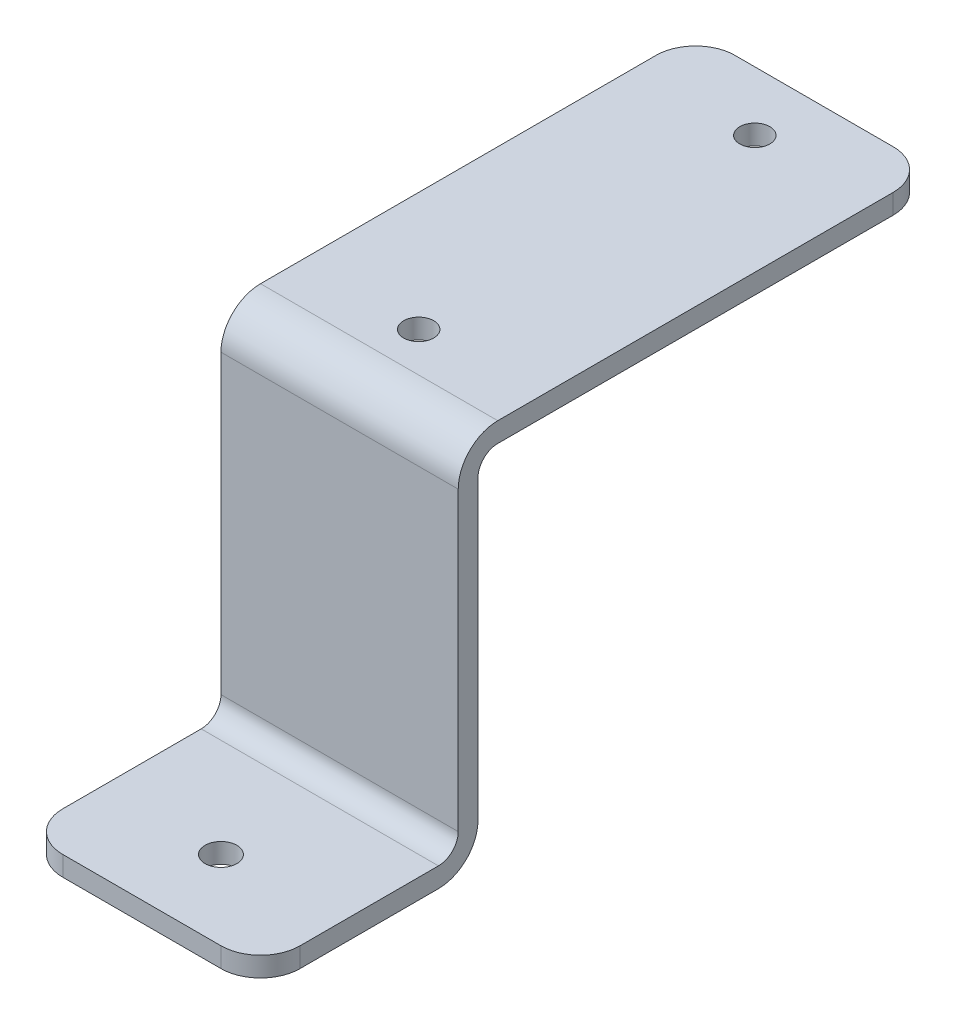
ISO-10303-21;
HEADER;
FILE_DESCRIPTION(('STEP AP214'),'2;1');
FILE_NAME('part.step','',(''),(''),'','','');
FILE_SCHEMA(('AUTOMOTIVE_DESIGN { 1 0 10303 214 1 1 1 1 }'));
ENDSEC;
DATA;
#1=APPLICATION_CONTEXT('core data for automotive mechanical design processes');
#2=APPLICATION_PROTOCOL_DEFINITION('international standard','automotive_design',2000,#1);
#3=PRODUCT_CONTEXT('',#1,'mechanical');
#4=PRODUCT('Part','Part','',(#3));
#5=PRODUCT_RELATED_PRODUCT_CATEGORY('part','',(#4));
#6=PRODUCT_DEFINITION_FORMATION('','',#4);
#7=PRODUCT_DEFINITION_CONTEXT('part definition',#1,'design');
#8=PRODUCT_DEFINITION('design','',#6,#7);
#9=PRODUCT_DEFINITION_SHAPE('','',#8);
#10=(LENGTH_UNIT() NAMED_UNIT(*) SI_UNIT(.MILLI.,.METRE.));
#11=(NAMED_UNIT(*) PLANE_ANGLE_UNIT() SI_UNIT($,.RADIAN.));
#12=(NAMED_UNIT(*) SI_UNIT($,.STERADIAN.) SOLID_ANGLE_UNIT());
#13=UNCERTAINTY_MEASURE_WITH_UNIT(LENGTH_MEASURE(1.E-05),#10,'distance_accuracy_value','');
#14=(GEOMETRIC_REPRESENTATION_CONTEXT(3) GLOBAL_UNCERTAINTY_ASSIGNED_CONTEXT((#13)) GLOBAL_UNIT_ASSIGNED_CONTEXT((#10,
#11,#12)) REPRESENTATION_CONTEXT('',''));
#15=CARTESIAN_POINT('',(0.,0.,0.));
#16=DIRECTION('',(0.,0.,1.));
#17=DIRECTION('',(1.,0.,0.));
#18=AXIS2_PLACEMENT_3D('',#15,#16,#17);
#19=CARTESIAN_POINT('',(-19.05,-60.325,0.));
#20=DIRECTION('',(0.,1.,0.));
#21=DIRECTION('',(0.,0.,1.));
#22=AXIS2_PLACEMENT_3D('',#19,#20,#21);
#23=PLANE('',#22);
#24=CARTESIAN_POINT('',(0.,-60.325,19.05));
#25=DIRECTION('',(0.,-1.,0.));
#26=DIRECTION('',(0.,0.,-1.));
#27=AXIS2_PLACEMENT_3D('',#24,#25,#26);
#28=CIRCLE('',#27,2.5527);
#29=CARTESIAN_POINT('',(0.,-60.325,16.4973));
#30=VERTEX_POINT('',#29);
#31=EDGE_CURVE('P0_E150',#30,#30,#28,.F.);
#32=ORIENTED_EDGE('',*,*,#31,.T.);
#33=EDGE_LOOP('',(#32));
#34=FACE_BOUND('',#33,.T.);
#35=CARTESIAN_POINT('',(-12.7,-60.325,25.4));
#36=DIRECTION('',(0.,1.,0.));
#37=DIRECTION('',(0.,0.,1.));
#38=AXIS2_PLACEMENT_3D('',#35,#36,#37);
#39=CIRCLE('',#38,6.35);
#40=CARTESIAN_POINT('',(-19.05,-60.325,25.4));
#41=VERTEX_POINT('',#40);
#42=CARTESIAN_POINT('',(-12.7,-60.325,31.75));
#43=VERTEX_POINT('',#42);
#44=EDGE_CURVE('P0_E20',#41,#43,#39,.T.);
#45=ORIENTED_EDGE('',*,*,#44,.F.);
#46=DIRECTION('',(0.,0.,1.));
#47=VECTOR('',#46,1.);
#48=CARTESIAN_POINT('',(-19.05,-60.325,15.08125));
#49=LINE('',#48,#47);
#50=CARTESIAN_POINT('',(-19.05,-60.325,3.175));
#51=VERTEX_POINT('',#50);
#52=EDGE_CURVE('P0_E129',#51,#41,#49,.T.);
#53=ORIENTED_EDGE('',*,*,#52,.F.);
#54=DIRECTION('',(1.,0.,0.));
#55=VECTOR('',#54,1.);
#56=CARTESIAN_POINT('',(-19.05,-60.325,3.175));
#57=LINE('',#56,#55);
#58=CARTESIAN_POINT('',(19.05,-60.325,3.175));
#59=VERTEX_POINT('',#58);
#60=EDGE_CURVE('P0_E234',#59,#51,#57,.F.);
#61=ORIENTED_EDGE('',*,*,#60,.F.);
#62=DIRECTION('',(0.,0.,1.));
#63=VECTOR('',#62,1.);
#64=CARTESIAN_POINT('',(19.05,-60.325,15.08125));
#65=LINE('',#64,#63);
#66=CARTESIAN_POINT('',(19.05,-60.325,25.4));
#67=VERTEX_POINT('',#66);
#68=EDGE_CURVE('P0_E157',#59,#67,#65,.T.);
#69=ORIENTED_EDGE('',*,*,#68,.T.);
#70=CARTESIAN_POINT('',(12.7,-60.325,25.4));
#71=DIRECTION('',(0.,1.,0.));
#72=DIRECTION('',(0.,0.,1.));
#73=AXIS2_PLACEMENT_3D('',#70,#71,#72);
#74=CIRCLE('',#73,6.35);
#75=CARTESIAN_POINT('',(12.7,-60.325,31.75));
#76=VERTEX_POINT('',#75);
#77=EDGE_CURVE('P0_E153',#76,#67,#74,.T.);
#78=ORIENTED_EDGE('',*,*,#77,.F.);
#79=DIRECTION('',(1.,0.,0.));
#80=VECTOR('',#79,1.);
#81=CARTESIAN_POINT('',(0.,-60.325,31.75));
#82=LINE('',#81,#80);
#83=EDGE_CURVE('P0_E132',#43,#76,#82,.T.);
#84=ORIENTED_EDGE('',*,*,#83,.F.);
#85=EDGE_LOOP('',(#45,#53,#61,#69,#78,#84));
#86=FACE_BOUND('',#85,.T.);
#87=ADVANCED_FACE('P0_F17',(#34,#86),#23,.F.);
#88=CARTESIAN_POINT('',(-12.7,-138.96467,25.4));
#89=DIRECTION('',(0.,1.,0.));
#90=DIRECTION('',(0.,0.,1.));
#91=AXIS2_PLACEMENT_3D('',#88,#89,#90);
#92=CYLINDRICAL_SURFACE('',#91,6.35);
#93=DIRECTION('',(0.,1.,0.));
#94=VECTOR('',#93,1.);
#95=CARTESIAN_POINT('',(-12.7,-58.7375,31.75));
#96=LINE('',#95,#94);
#97=CARTESIAN_POINT('',(-12.7,-57.15,31.75));
#98=VERTEX_POINT('',#97);
#99=EDGE_CURVE('P0_E135',#98,#43,#96,.F.);
#100=ORIENTED_EDGE('',*,*,#99,.F.);
#101=CARTESIAN_POINT('',(-12.7,-57.15,25.4));
#102=DIRECTION('',(0.,1.,0.));
#103=DIRECTION('',(0.,0.,1.));
#104=AXIS2_PLACEMENT_3D('',#101,#102,#103);
#105=CIRCLE('',#104,6.35);
#106=CARTESIAN_POINT('',(-19.05,-57.15,25.4));
#107=VERTEX_POINT('',#106);
#108=EDGE_CURVE('P0_E140',#107,#98,#105,.T.);
#109=ORIENTED_EDGE('',*,*,#108,.F.);
#110=DIRECTION('',(0.,1.,0.));
#111=VECTOR('',#110,1.);
#112=CARTESIAN_POINT('',(-19.05,-58.7375,25.4));
#113=LINE('',#112,#111);
#114=EDGE_CURVE('P0_E137',#41,#107,#113,.T.);
#115=ORIENTED_EDGE('',*,*,#114,.F.);
#116=ORIENTED_EDGE('',*,*,#44,.T.);
#117=EDGE_LOOP('',(#100,#109,#115,#116));
#118=FACE_BOUND('',#117,.T.);
#119=ADVANCED_FACE('P0_F138',(#118),#92,.T.);
#120=CARTESIAN_POINT('',(0.,-58.7375,31.75));
#121=DIRECTION('',(0.,0.,1.));
#122=DIRECTION('',(1.,0.,0.));
#123=AXIS2_PLACEMENT_3D('',#120,#121,#122);
#124=PLANE('',#123);
#125=ORIENTED_EDGE('',*,*,#83,.T.);
#126=DIRECTION('',(0.,1.,0.));
#127=VECTOR('',#126,1.);
#128=CARTESIAN_POINT('',(12.7,-138.96467,31.75));
#129=LINE('',#128,#127);
#130=CARTESIAN_POINT('',(12.7,-57.15,31.75));
#131=VERTEX_POINT('',#130);
#132=EDGE_CURVE('P0_E159',#131,#76,#129,.F.);
#133=ORIENTED_EDGE('',*,*,#132,.F.);
#134=DIRECTION('',(1.,0.,0.));
#135=VECTOR('',#134,1.);
#136=CARTESIAN_POINT('',(-19.05,-57.15,31.75));
#137=LINE('',#136,#135);
#138=EDGE_CURVE('P0_E225',#98,#131,#137,.T.);
#139=ORIENTED_EDGE('',*,*,#138,.F.);
#140=ORIENTED_EDGE('',*,*,#99,.T.);
#141=EDGE_LOOP('',(#125,#133,#139,#140));
#142=FACE_BOUND('',#141,.T.);
#143=ADVANCED_FACE('P0_F383',(#142),#124,.T.);
#144=CARTESIAN_POINT('',(12.7,-138.96467,25.4));
#145=DIRECTION('',(0.,1.,0.));
#146=DIRECTION('',(0.,0.,1.));
#147=AXIS2_PLACEMENT_3D('',#144,#145,#146);
#148=CYLINDRICAL_SURFACE('',#147,6.35);
#149=DIRECTION('',(0.,1.,0.));
#150=VECTOR('',#149,1.);
#151=CARTESIAN_POINT('',(19.05,-58.7375,25.4));
#152=LINE('',#151,#150);
#153=CARTESIAN_POINT('',(19.05,-57.15,25.4));
#154=VERTEX_POINT('',#153);
#155=EDGE_CURVE('P0_E143',#67,#154,#152,.T.);
#156=ORIENTED_EDGE('',*,*,#155,.T.);
#157=CARTESIAN_POINT('',(12.7,-57.15,25.4));
#158=DIRECTION('',(0.,1.,0.));
#159=DIRECTION('',(0.,0.,1.));
#160=AXIS2_PLACEMENT_3D('',#157,#158,#159);
#161=CIRCLE('',#160,6.35);
#162=EDGE_CURVE('P0_E222',#131,#154,#161,.T.);
#163=ORIENTED_EDGE('',*,*,#162,.F.);
#164=ORIENTED_EDGE('',*,*,#132,.T.);
#165=ORIENTED_EDGE('',*,*,#77,.T.);
#166=EDGE_LOOP('',(#156,#163,#164,#165));
#167=FACE_BOUND('',#166,.T.);
#168=ADVANCED_FACE('P0_F229',(#167),#148,.T.);
#169=CARTESIAN_POINT('',(0.,9.350375,19.05));
#170=DIRECTION('',(0.,-1.,0.));
#171=DIRECTION('',(0.,0.,-1.));
#172=AXIS2_PLACEMENT_3D('',#169,#170,#171);
#173=CYLINDRICAL_SURFACE('',#172,2.5527);
#174=ORIENTED_EDGE('',*,*,#31,.F.);
#175=EDGE_LOOP('',(#174));
#176=FACE_BOUND('',#175,.T.);
#177=CARTESIAN_POINT('',(0.,-57.15,19.05));
#178=DIRECTION('',(0.,-1.,0.));
#179=DIRECTION('',(0.,0.,-1.));
#180=AXIS2_PLACEMENT_3D('',#177,#178,#179);
#181=CIRCLE('',#180,2.5527);
#182=CARTESIAN_POINT('',(0.,-57.15,16.4973));
#183=VERTEX_POINT('',#182);
#184=EDGE_CURVE('P0_E219',#183,#183,#181,.T.);
#185=ORIENTED_EDGE('',*,*,#184,.F.);
#186=EDGE_LOOP('',(#185));
#187=FACE_BOUND('',#186,.T.);
#188=ADVANCED_FACE('P0_F377',(#176,#187),#173,.F.);
#189=CARTESIAN_POINT('',(-19.05,-53.975,3.175));
#190=DIRECTION('',(1.,0.,0.));
#191=DIRECTION('',(0.,0.,-1.));
#192=AXIS2_PLACEMENT_3D('',#189,#190,#191);
#193=CYLINDRICAL_SURFACE('',#192,6.35);
#194=CARTESIAN_POINT('',(19.05,-53.975,3.175));
#195=DIRECTION('',(1.,0.,0.));
#196=DIRECTION('',(0.,0.,-1.));
#197=AXIS2_PLACEMENT_3D('',#194,#195,#196);
#198=CIRCLE('',#197,6.35);
#199=CARTESIAN_POINT('',(19.05,-53.975,-3.175));
#200=VERTEX_POINT('',#199);
#201=EDGE_CURVE('P0_E214',#59,#200,#198,.T.);
#202=ORIENTED_EDGE('',*,*,#201,.F.);
#203=ORIENTED_EDGE('',*,*,#60,.T.);
#204=CARTESIAN_POINT('',(-19.05,-53.975,3.175));
#205=DIRECTION('',(1.,0.,0.));
#206=DIRECTION('',(0.,0.,-1.));
#207=AXIS2_PLACEMENT_3D('',#204,#205,#206);
#208=CIRCLE('',#207,6.35);
#209=CARTESIAN_POINT('',(-19.05,-53.975,-3.175));
#210=VERTEX_POINT('',#209);
#211=EDGE_CURVE('P0_E149',#51,#210,#208,.T.);
#212=ORIENTED_EDGE('',*,*,#211,.T.);
#213=DIRECTION('',(1.,0.,0.));
#214=VECTOR('',#213,1.);
#215=CARTESIAN_POINT('',(-19.05,-53.975,-3.175));
#216=LINE('',#215,#214);
#217=EDGE_CURVE('P0_E217',#210,#200,#216,.T.);
#218=ORIENTED_EDGE('',*,*,#217,.T.);
#219=EDGE_LOOP('',(#202,#203,#212,#218));
#220=FACE_BOUND('',#219,.T.);
#221=ADVANCED_FACE('P0_F252',(#220),#193,.T.);
#222=CARTESIAN_POINT('',(-19.05,-57.15,0.));
#223=DIRECTION('',(0.,1.,0.));
#224=DIRECTION('',(0.,0.,1.));
#225=AXIS2_PLACEMENT_3D('',#222,#223,#224);
#226=PLANE('',#225);
#227=ORIENTED_EDGE('',*,*,#184,.T.);
#228=EDGE_LOOP('',(#227));
#229=FACE_BOUND('',#228,.T.);
#230=ORIENTED_EDGE('',*,*,#138,.T.);
#231=ORIENTED_EDGE('',*,*,#162,.T.);
#232=DIRECTION('',(0.,0.,1.));
#233=VECTOR('',#232,1.);
#234=CARTESIAN_POINT('',(19.05,-57.15,0.));
#235=LINE('',#234,#233);
#236=CARTESIAN_POINT('',(19.05,-57.15,3.175));
#237=VERTEX_POINT('',#236);
#238=EDGE_CURVE('P0_E237',#154,#237,#235,.F.);
#239=ORIENTED_EDGE('',*,*,#238,.T.);
#240=DIRECTION('',(1.,0.,0.));
#241=VECTOR('',#240,1.);
#242=CARTESIAN_POINT('',(-19.05,-57.15,3.175));
#243=LINE('',#242,#241);
#244=CARTESIAN_POINT('',(-19.05,-57.15,3.175));
#245=VERTEX_POINT('',#244);
#246=EDGE_CURVE('P0_E213',#237,#245,#243,.F.);
#247=ORIENTED_EDGE('',*,*,#246,.T.);
#248=DIRECTION('',(0.,0.,1.));
#249=VECTOR('',#248,1.);
#250=CARTESIAN_POINT('',(-19.05,-57.15,0.));
#251=LINE('',#250,#249);
#252=EDGE_CURVE('P0_E226',#245,#107,#251,.T.);
#253=ORIENTED_EDGE('',*,*,#252,.T.);
#254=ORIENTED_EDGE('',*,*,#108,.T.);
#255=EDGE_LOOP('',(#230,#231,#239,#247,#253,#254));
#256=FACE_BOUND('',#255,.T.);
#257=ADVANCED_FACE('P0_F244',(#229,#256),#226,.T.);
#258=CARTESIAN_POINT('',(-19.05,0.,-3.175));
#259=DIRECTION('',(0.,0.,1.));
#260=DIRECTION('',(1.,0.,0.));
#261=AXIS2_PLACEMENT_3D('',#258,#259,#260);
#262=PLANE('',#261);
#263=DIRECTION('',(0.,1.,0.));
#264=VECTOR('',#263,1.);
#265=CARTESIAN_POINT('',(19.05,-30.1625,-3.175));
#266=LINE('',#265,#264);
#267=CARTESIAN_POINT('',(19.05,-6.35,-3.175));
#268=VERTEX_POINT('',#267);
#269=EDGE_CURVE('P0_E256',#268,#200,#266,.F.);
#270=ORIENTED_EDGE('',*,*,#269,.T.);
#271=ORIENTED_EDGE('',*,*,#217,.F.);
#272=DIRECTION('',(0.,1.,0.));
#273=VECTOR('',#272,1.);
#274=CARTESIAN_POINT('',(-19.05,-30.1625,-3.175));
#275=LINE('',#274,#273);
#276=CARTESIAN_POINT('',(-19.05,-6.35,-3.175));
#277=VERTEX_POINT('',#276);
#278=EDGE_CURVE('P0_E210',#277,#210,#275,.F.);
#279=ORIENTED_EDGE('',*,*,#278,.F.);
#280=DIRECTION('',(-1.,0.,0.));
#281=VECTOR('',#280,1.);
#282=CARTESIAN_POINT('',(-19.05,-6.35,-3.175));
#283=LINE('',#282,#281);
#284=EDGE_CURVE('P0_E206',#277,#268,#283,.F.);
#285=ORIENTED_EDGE('',*,*,#284,.T.);
#286=EDGE_LOOP('',(#270,#271,#279,#285));
#287=FACE_BOUND('',#286,.T.);
#288=ADVANCED_FACE('P0_F369',(#287),#262,.F.);
#289=CARTESIAN_POINT('',(-19.05,-53.975,3.175));
#290=DIRECTION('',(1.,0.,0.));
#291=DIRECTION('',(0.,0.,-1.));
#292=AXIS2_PLACEMENT_3D('',#289,#290,#291);
#293=CYLINDRICAL_SURFACE('',#292,3.175);
#294=DIRECTION('',(1.,0.,0.));
#295=VECTOR('',#294,1.);
#296=CARTESIAN_POINT('',(-19.05,-53.975,0.));
#297=LINE('',#296,#295);
#298=CARTESIAN_POINT('',(-19.05,-53.975,0.));
#299=VERTEX_POINT('',#298);
#300=CARTESIAN_POINT('',(19.05,-53.975,0.));
#301=VERTEX_POINT('',#300);
#302=EDGE_CURVE('P0_E205',#299,#301,#297,.T.);
#303=ORIENTED_EDGE('',*,*,#302,.F.);
#304=CARTESIAN_POINT('',(-19.05,-53.975,3.175));
#305=DIRECTION('',(1.,0.,0.));
#306=DIRECTION('',(0.,0.,-1.));
#307=AXIS2_PLACEMENT_3D('',#304,#305,#306);
#308=CIRCLE('',#307,3.175);
#309=EDGE_CURVE('P0_E211',#245,#299,#308,.T.);
#310=ORIENTED_EDGE('',*,*,#309,.F.);
#311=ORIENTED_EDGE('',*,*,#246,.F.);
#312=CARTESIAN_POINT('',(19.05,-53.975,3.175));
#313=DIRECTION('',(1.,0.,0.));
#314=DIRECTION('',(0.,0.,-1.));
#315=AXIS2_PLACEMENT_3D('',#312,#313,#314);
#316=CIRCLE('',#315,3.175);
#317=EDGE_CURVE('P0_E207',#301,#237,#316,.F.);
#318=ORIENTED_EDGE('',*,*,#317,.F.);
#319=EDGE_LOOP('',(#303,#310,#311,#318));
#320=FACE_BOUND('',#319,.T.);
#321=ADVANCED_FACE('P0_F292',(#320),#293,.F.);
#322=CARTESIAN_POINT('',(-19.05,-6.35,-6.35));
#323=DIRECTION('',(-1.,0.,0.));
#324=DIRECTION('',(0.,0.,1.));
#325=AXIS2_PLACEMENT_3D('',#322,#323,#324);
#326=CYLINDRICAL_SURFACE('',#325,3.175);
#327=DIRECTION('',(1.,0.,0.));
#328=VECTOR('',#327,1.);
#329=CARTESIAN_POINT('',(-19.05,-3.175,-6.34999999999999));
#330=LINE('',#329,#328);
#331=CARTESIAN_POINT('',(-19.05,-3.175,-6.35));
#332=VERTEX_POINT('',#331);
#333=CARTESIAN_POINT('',(19.05,-3.175,-6.35));
#334=VERTEX_POINT('',#333);
#335=EDGE_CURVE('P0_E201',#332,#334,#330,.T.);
#336=ORIENTED_EDGE('',*,*,#335,.T.);
#337=CARTESIAN_POINT('',(19.05,-6.35,-6.35));
#338=DIRECTION('',(-1.,0.,0.));
#339=DIRECTION('',(0.,0.,1.));
#340=AXIS2_PLACEMENT_3D('',#337,#338,#339);
#341=CIRCLE('',#340,3.175);
#342=EDGE_CURVE('P0_E198',#268,#334,#341,.T.);
#343=ORIENTED_EDGE('',*,*,#342,.F.);
#344=ORIENTED_EDGE('',*,*,#284,.F.);
#345=CARTESIAN_POINT('',(-19.05,-6.35,-6.35));
#346=DIRECTION('',(-1.,0.,0.));
#347=DIRECTION('',(0.,0.,1.));
#348=AXIS2_PLACEMENT_3D('',#345,#346,#347);
#349=CIRCLE('',#348,3.175);
#350=EDGE_CURVE('P0_E203',#277,#332,#349,.T.);
#351=ORIENTED_EDGE('',*,*,#350,.T.);
#352=EDGE_LOOP('',(#336,#343,#344,#351));
#353=FACE_BOUND('',#352,.T.);
#354=ADVANCED_FACE('P0_F262',(#353),#326,.F.);
#355=CARTESIAN_POINT('',(-19.05,0.,0.));
#356=DIRECTION('',(0.,0.,1.));
#357=DIRECTION('',(1.,0.,0.));
#358=AXIS2_PLACEMENT_3D('',#355,#356,#357);
#359=PLANE('',#358);
#360=DIRECTION('',(-1.,0.,0.));
#361=VECTOR('',#360,1.);
#362=CARTESIAN_POINT('',(-19.05,-6.35,0.));
#363=LINE('',#362,#361);
#364=CARTESIAN_POINT('',(-19.05,-6.35,0.));
#365=VERTEX_POINT('',#364);
#366=CARTESIAN_POINT('',(19.05,-6.35,0.));
#367=VERTEX_POINT('',#366);
#368=EDGE_CURVE('P0_E189',#365,#367,#363,.F.);
#369=ORIENTED_EDGE('',*,*,#368,.F.);
#370=DIRECTION('',(0.,1.,0.));
#371=VECTOR('',#370,1.);
#372=CARTESIAN_POINT('',(-19.05,0.,0.));
#373=LINE('',#372,#371);
#374=EDGE_CURVE('P0_E202',#365,#299,#373,.F.);
#375=ORIENTED_EDGE('',*,*,#374,.T.);
#376=ORIENTED_EDGE('',*,*,#302,.T.);
#377=DIRECTION('',(0.,1.,0.));
#378=VECTOR('',#377,1.);
#379=CARTESIAN_POINT('',(19.05,0.,0.));
#380=LINE('',#379,#378);
#381=EDGE_CURVE('P0_E282',#301,#367,#380,.T.);
#382=ORIENTED_EDGE('',*,*,#381,.T.);
#383=EDGE_LOOP('',(#369,#375,#376,#382));
#384=FACE_BOUND('',#383,.T.);
#385=ADVANCED_FACE('P0_F296',(#384),#359,.T.);
#386=CARTESIAN_POINT('',(-19.05,-3.175,-76.2));
#387=DIRECTION('',(0.,1.,0.));
#388=DIRECTION('',(0.,0.,1.));
#389=AXIS2_PLACEMENT_3D('',#386,#387,#388);
#390=PLANE('',#389);
#391=CARTESIAN_POINT('',(0.,-3.175,-66.675));
#392=DIRECTION('',(0.,1.,0.));
#393=DIRECTION('',(0.,0.,1.));
#394=AXIS2_PLACEMENT_3D('',#391,#392,#393);
#395=CIRCLE('',#394,2.413);
#396=CARTESIAN_POINT('',(0.,-3.175,-64.262));
#397=VERTEX_POINT('',#396);
#398=EDGE_CURVE('P0_E176',#397,#397,#395,.T.);
#399=ORIENTED_EDGE('',*,*,#398,.T.);
#400=EDGE_LOOP('',(#399));
#401=FACE_BOUND('',#400,.T.);
#402=CARTESIAN_POINT('',(0.,-3.175,-12.7));
#403=DIRECTION('',(0.,1.,0.));
#404=DIRECTION('',(0.,0.,1.));
#405=AXIS2_PLACEMENT_3D('',#402,#403,#404);
#406=CIRCLE('',#405,2.413);
#407=CARTESIAN_POINT('',(0.,-3.175,-10.287));
#408=VERTEX_POINT('',#407);
#409=EDGE_CURVE('P0_E179',#408,#408,#406,.T.);
#410=ORIENTED_EDGE('',*,*,#409,.T.);
#411=EDGE_LOOP('',(#410));
#412=FACE_BOUND('',#411,.T.);
#413=ORIENTED_EDGE('',*,*,#335,.F.);
#414=DIRECTION('',(0.,0.,1.));
#415=VECTOR('',#414,1.);
#416=CARTESIAN_POINT('',(-19.05,-3.175,-38.89375));
#417=LINE('',#416,#415);
#418=CARTESIAN_POINT('',(-19.05,-3.17500000000001,-69.85));
#419=VERTEX_POINT('',#418);
#420=EDGE_CURVE('P0_E196',#419,#332,#417,.T.);
#421=ORIENTED_EDGE('',*,*,#420,.F.);
#422=CARTESIAN_POINT('',(-12.7,-3.17500000000001,-69.85));
#423=DIRECTION('',(0.,1.,0.));
#424=DIRECTION('',(0.,0.,1.));
#425=AXIS2_PLACEMENT_3D('',#422,#423,#424);
#426=CIRCLE('',#425,6.35);
#427=CARTESIAN_POINT('',(-12.7,-3.17500000000001,-76.2));
#428=VERTEX_POINT('',#427);
#429=EDGE_CURVE('P0_E193',#428,#419,#426,.T.);
#430=ORIENTED_EDGE('',*,*,#429,.F.);
#431=DIRECTION('',(1.,0.,0.));
#432=VECTOR('',#431,1.);
#433=CARTESIAN_POINT('',(0.,-3.175,-76.2));
#434=LINE('',#433,#432);
#435=CARTESIAN_POINT('',(12.7,-3.17500000000001,-76.2));
#436=VERTEX_POINT('',#435);
#437=EDGE_CURVE('P0_E268',#428,#436,#434,.T.);
#438=ORIENTED_EDGE('',*,*,#437,.T.);
#439=CARTESIAN_POINT('',(12.7,-3.17500000000001,-69.85));
#440=DIRECTION('',(0.,1.,0.));
#441=DIRECTION('',(0.,0.,1.));
#442=AXIS2_PLACEMENT_3D('',#439,#440,#441);
#443=CIRCLE('',#442,6.35);
#444=CARTESIAN_POINT('',(19.05,-3.17500000000001,-69.85));
#445=VERTEX_POINT('',#444);
#446=EDGE_CURVE('P0_E183',#445,#436,#443,.T.);
#447=ORIENTED_EDGE('',*,*,#446,.F.);
#448=DIRECTION('',(0.,0.,1.));
#449=VECTOR('',#448,1.);
#450=CARTESIAN_POINT('',(19.05,-3.175,-38.89375));
#451=LINE('',#450,#449);
#452=EDGE_CURVE('P0_E271',#445,#334,#451,.T.);
#453=ORIENTED_EDGE('',*,*,#452,.T.);
#454=EDGE_LOOP('',(#413,#421,#430,#438,#447,#453));
#455=FACE_BOUND('',#454,.T.);
#456=ADVANCED_FACE('P0_F272',(#401,#412,#455),#390,.F.);
#457=CARTESIAN_POINT('',(0.,-1.5875,-76.2));
#458=DIRECTION('',(0.,0.,1.));
#459=DIRECTION('',(1.,0.,0.));
#460=AXIS2_PLACEMENT_3D('',#457,#458,#459);
#461=PLANE('',#460);
#462=DIRECTION('',(0.,1.,0.));
#463=VECTOR('',#462,1.);
#464=CARTESIAN_POINT('',(-12.7,-138.96467,-76.2));
#465=LINE('',#464,#463);
#466=CARTESIAN_POINT('',(-12.7,0.,-76.2));
#467=VERTEX_POINT('',#466);
#468=EDGE_CURVE('P0_E197',#467,#428,#465,.F.);
#469=ORIENTED_EDGE('',*,*,#468,.F.);
#470=DIRECTION('',(1.,0.,0.));
#471=VECTOR('',#470,1.);
#472=CARTESIAN_POINT('',(-19.05,0.,-76.2));
#473=LINE('',#472,#471);
#474=CARTESIAN_POINT('',(12.7,0.,-76.2));
#475=VERTEX_POINT('',#474);
#476=EDGE_CURVE('P0_E175',#475,#467,#473,.F.);
#477=ORIENTED_EDGE('',*,*,#476,.F.);
#478=DIRECTION('',(0.,1.,0.));
#479=VECTOR('',#478,1.);
#480=CARTESIAN_POINT('',(12.7,-138.96467,-76.2));
#481=LINE('',#480,#479);
#482=EDGE_CURVE('P0_E182',#436,#475,#481,.T.);
#483=ORIENTED_EDGE('',*,*,#482,.F.);
#484=ORIENTED_EDGE('',*,*,#437,.F.);
#485=EDGE_LOOP('',(#469,#477,#483,#484));
#486=FACE_BOUND('',#485,.T.);
#487=ADVANCED_FACE('P0_F320',(#486),#461,.F.);
#488=CARTESIAN_POINT('',(-12.7,-138.96467,-69.85));
#489=DIRECTION('',(0.,1.,0.));
#490=DIRECTION('',(0.,0.,1.));
#491=AXIS2_PLACEMENT_3D('',#488,#489,#490);
#492=CYLINDRICAL_SURFACE('',#491,6.35);
#493=DIRECTION('',(0.,1.,0.));
#494=VECTOR('',#493,1.);
#495=CARTESIAN_POINT('',(-19.05,-1.5875,-69.85));
#496=LINE('',#495,#494);
#497=CARTESIAN_POINT('',(-19.05,0.,-69.85));
#498=VERTEX_POINT('',#497);
#499=EDGE_CURVE('P0_E192',#498,#419,#496,.F.);
#500=ORIENTED_EDGE('',*,*,#499,.F.);
#501=CARTESIAN_POINT('',(-12.7,0.,-69.85));
#502=DIRECTION('',(0.,1.,0.));
#503=DIRECTION('',(0.,0.,1.));
#504=AXIS2_PLACEMENT_3D('',#501,#502,#503);
#505=CIRCLE('',#504,6.35);
#506=EDGE_CURVE('P0_E171',#467,#498,#505,.T.);
#507=ORIENTED_EDGE('',*,*,#506,.F.);
#508=ORIENTED_EDGE('',*,*,#468,.T.);
#509=ORIENTED_EDGE('',*,*,#429,.T.);
#510=EDGE_LOOP('',(#500,#507,#508,#509));
#511=FACE_BOUND('',#510,.T.);
#512=ADVANCED_FACE('P0_F360',(#511),#492,.T.);
#513=CARTESIAN_POINT('',(-19.05,-1.5875,-38.89375));
#514=DIRECTION('',(-1.,0.,0.));
#515=DIRECTION('',(0.,0.,1.));
#516=AXIS2_PLACEMENT_3D('',#513,#514,#515);
#517=PLANE('',#516);
#518=DIRECTION('',(0.,0.,1.));
#519=VECTOR('',#518,1.);
#520=CARTESIAN_POINT('',(-19.05,0.,-76.2));
#521=LINE('',#520,#519);
#522=CARTESIAN_POINT('',(-19.05,0.,-6.35));
#523=VERTEX_POINT('',#522);
#524=EDGE_CURVE('P0_E174',#498,#523,#521,.T.);
#525=ORIENTED_EDGE('',*,*,#524,.F.);
#526=ORIENTED_EDGE('',*,*,#499,.T.);
#527=ORIENTED_EDGE('',*,*,#420,.T.);
#528=ORIENTED_EDGE('',*,*,#350,.F.);
#529=ORIENTED_EDGE('',*,*,#278,.T.);
#530=ORIENTED_EDGE('',*,*,#211,.F.);
#531=ORIENTED_EDGE('',*,*,#52,.T.);
#532=ORIENTED_EDGE('',*,*,#114,.T.);
#533=ORIENTED_EDGE('',*,*,#252,.F.);
#534=ORIENTED_EDGE('',*,*,#309,.T.);
#535=ORIENTED_EDGE('',*,*,#374,.F.);
#536=CARTESIAN_POINT('',(-19.05,-6.35,-6.35));
#537=DIRECTION('',(-1.,0.,0.));
#538=DIRECTION('',(0.,0.,1.));
#539=AXIS2_PLACEMENT_3D('',#536,#537,#538);
#540=CIRCLE('',#539,6.35);
#541=EDGE_CURVE('P0_E186',#523,#365,#540,.F.);
#542=ORIENTED_EDGE('',*,*,#541,.F.);
#543=EDGE_LOOP('',(#525,#526,#527,#528,#529,#530,#531,#532,#533,#534,#535,#542));
#544=FACE_BOUND('',#543,.T.);
#545=ADVANCED_FACE('P0_F147',(#544),#517,.T.);
#546=CARTESIAN_POINT('',(-19.05,-6.35,-6.35));
#547=DIRECTION('',(-1.,0.,0.));
#548=DIRECTION('',(0.,0.,1.));
#549=AXIS2_PLACEMENT_3D('',#546,#547,#548);
#550=CYLINDRICAL_SURFACE('',#549,6.35);
#551=ORIENTED_EDGE('',*,*,#541,.T.);
#552=ORIENTED_EDGE('',*,*,#368,.T.);
#553=CARTESIAN_POINT('',(19.05,-6.35,-6.35));
#554=DIRECTION('',(-1.,0.,0.));
#555=DIRECTION('',(0.,0.,1.));
#556=AXIS2_PLACEMENT_3D('',#553,#554,#555);
#557=CIRCLE('',#556,6.35);
#558=CARTESIAN_POINT('',(19.05,0.,-6.35));
#559=VERTEX_POINT('',#558);
#560=EDGE_CURVE('P0_E190',#367,#559,#557,.T.);
#561=ORIENTED_EDGE('',*,*,#560,.T.);
#562=DIRECTION('',(1.,0.,0.));
#563=VECTOR('',#562,1.);
#564=CARTESIAN_POINT('',(-19.05,0.,-6.34999999999999));
#565=LINE('',#564,#563);
#566=EDGE_CURVE('P0_E300',#523,#559,#565,.T.);
#567=ORIENTED_EDGE('',*,*,#566,.F.);
#568=EDGE_LOOP('',(#551,#552,#561,#567));
#569=FACE_BOUND('',#568,.T.);
#570=ADVANCED_FACE('P0_F298',(#569),#550,.T.);
#571=CARTESIAN_POINT('',(19.05,-1.5875,-38.89375));
#572=DIRECTION('',(-1.,0.,0.));
#573=DIRECTION('',(0.,0.,1.));
#574=AXIS2_PLACEMENT_3D('',#571,#572,#573);
#575=PLANE('',#574);
#576=DIRECTION('',(0.,0.,1.));
#577=VECTOR('',#576,1.);
#578=CARTESIAN_POINT('',(19.05,0.,-76.2));
#579=LINE('',#578,#577);
#580=CARTESIAN_POINT('',(19.05,0.,-69.85));
#581=VERTEX_POINT('',#580);
#582=EDGE_CURVE('P0_E170',#559,#581,#579,.F.);
#583=ORIENTED_EDGE('',*,*,#582,.F.);
#584=ORIENTED_EDGE('',*,*,#560,.F.);
#585=ORIENTED_EDGE('',*,*,#381,.F.);
#586=ORIENTED_EDGE('',*,*,#317,.T.);
#587=ORIENTED_EDGE('',*,*,#238,.F.);
#588=ORIENTED_EDGE('',*,*,#155,.F.);
#589=ORIENTED_EDGE('',*,*,#68,.F.);
#590=ORIENTED_EDGE('',*,*,#201,.T.);
#591=ORIENTED_EDGE('',*,*,#269,.F.);
#592=ORIENTED_EDGE('',*,*,#342,.T.);
#593=ORIENTED_EDGE('',*,*,#452,.F.);
#594=DIRECTION('',(0.,1.,0.));
#595=VECTOR('',#594,1.);
#596=CARTESIAN_POINT('',(19.05,-138.96467,-69.85));
#597=LINE('',#596,#595);
#598=EDGE_CURVE('P0_E35',#581,#445,#597,.F.);
#599=ORIENTED_EDGE('',*,*,#598,.F.);
#600=EDGE_LOOP('',(#583,#584,#585,#586,#587,#588,#589,#590,#591,#592,#593,#599));
#601=FACE_BOUND('',#600,.T.);
#602=ADVANCED_FACE('P0_F236',(#601),#575,.F.);
#603=CARTESIAN_POINT('',(12.7,-138.96467,-69.85));
#604=DIRECTION('',(0.,1.,0.));
#605=DIRECTION('',(0.,0.,1.));
#606=AXIS2_PLACEMENT_3D('',#603,#604,#605);
#607=CYLINDRICAL_SURFACE('',#606,6.35);
#608=ORIENTED_EDGE('',*,*,#482,.T.);
#609=CARTESIAN_POINT('',(12.7,0.,-69.85));
#610=DIRECTION('',(0.,1.,0.));
#611=DIRECTION('',(0.,0.,1.));
#612=AXIS2_PLACEMENT_3D('',#609,#610,#611);
#613=CIRCLE('',#612,6.35);
#614=EDGE_CURVE('P0_E167',#581,#475,#613,.T.);
#615=ORIENTED_EDGE('',*,*,#614,.F.);
#616=ORIENTED_EDGE('',*,*,#598,.T.);
#617=ORIENTED_EDGE('',*,*,#446,.T.);
#618=EDGE_LOOP('',(#608,#615,#616,#617));
#619=FACE_BOUND('',#618,.T.);
#620=ADVANCED_FACE('P0_F322',(#619),#607,.T.);
#621=CARTESIAN_POINT('',(0.,-3.175,-12.7));
#622=DIRECTION('',(0.,1.,0.));
#623=DIRECTION('',(0.,0.,1.));
#624=AXIS2_PLACEMENT_3D('',#621,#622,#623);
#625=CYLINDRICAL_SURFACE('',#624,2.413);
#626=ORIENTED_EDGE('',*,*,#409,.F.);
#627=EDGE_LOOP('',(#626));
#628=FACE_BOUND('',#627,.T.);
#629=CARTESIAN_POINT('',(0.,0.,-12.7));
#630=DIRECTION('',(0.,1.,0.));
#631=DIRECTION('',(0.,0.,1.));
#632=AXIS2_PLACEMENT_3D('',#629,#630,#631);
#633=CIRCLE('',#632,2.413);
#634=CARTESIAN_POINT('',(0.,0.,-10.287));
#635=VERTEX_POINT('',#634);
#636=EDGE_CURVE('P0_E26',#635,#635,#633,.F.);
#637=ORIENTED_EDGE('',*,*,#636,.F.);
#638=EDGE_LOOP('',(#637));
#639=FACE_BOUND('',#638,.T.);
#640=ADVANCED_FACE('P0_F324',(#628,#639),#625,.F.);
#641=CARTESIAN_POINT('',(0.,-3.175,-66.675));
#642=DIRECTION('',(0.,1.,0.));
#643=DIRECTION('',(0.,0.,1.));
#644=AXIS2_PLACEMENT_3D('',#641,#642,#643);
#645=CYLINDRICAL_SURFACE('',#644,2.413);
#646=ORIENTED_EDGE('',*,*,#398,.F.);
#647=EDGE_LOOP('',(#646));
#648=FACE_BOUND('',#647,.T.);
#649=CARTESIAN_POINT('',(0.,0.,-66.675));
#650=DIRECTION('',(0.,1.,0.));
#651=DIRECTION('',(0.,0.,1.));
#652=AXIS2_PLACEMENT_3D('',#649,#650,#651);
#653=CIRCLE('',#652,2.413);
#654=CARTESIAN_POINT('',(0.,0.,-64.262));
#655=VERTEX_POINT('',#654);
#656=EDGE_CURVE('P0_E11',#655,#655,#653,.F.);
#657=ORIENTED_EDGE('',*,*,#656,.F.);
#658=EDGE_LOOP('',(#657));
#659=FACE_BOUND('',#658,.T.);
#660=ADVANCED_FACE('P0_F331',(#648,#659),#645,.F.);
#661=CARTESIAN_POINT('',(-19.05,0.,-76.2));
#662=DIRECTION('',(0.,1.,0.));
#663=DIRECTION('',(0.,0.,1.));
#664=AXIS2_PLACEMENT_3D('',#661,#662,#663);
#665=PLANE('',#664);
#666=ORIENTED_EDGE('',*,*,#656,.T.);
#667=EDGE_LOOP('',(#666));
#668=FACE_BOUND('',#667,.T.);
#669=ORIENTED_EDGE('',*,*,#636,.T.);
#670=EDGE_LOOP('',(#669));
#671=FACE_BOUND('',#670,.T.);
#672=ORIENTED_EDGE('',*,*,#582,.T.);
#673=ORIENTED_EDGE('',*,*,#614,.T.);
#674=ORIENTED_EDGE('',*,*,#476,.T.);
#675=ORIENTED_EDGE('',*,*,#506,.T.);
#676=ORIENTED_EDGE('',*,*,#524,.T.);
#677=ORIENTED_EDGE('',*,*,#566,.T.);
#678=EDGE_LOOP('',(#672,#673,#674,#675,#676,#677));
#679=FACE_BOUND('',#678,.T.);
#680=ADVANCED_FACE('P0_F305',(#668,#671,#679),#665,.T.);
#681=CLOSED_SHELL('',(#87,#119,#143,#168,#188,#221,#257,#288,#321,#354,#385,#456,#487,#512,#545,
#570,#602,#620,#640,#660,#680));
#682=MANIFOLD_SOLID_BREP('P0_B1',#681);
#683=CARTESIAN_POINT('',(0.,9.350375,19.05));
#684=DIRECTION('',(0.,-1.,0.));
#685=DIRECTION('',(0.,0.,-1.));
#686=AXIS2_PLACEMENT_3D('',#683,#684,#685);
#687=CYLINDRICAL_SURFACE('',#686,3.175);
#688=CARTESIAN_POINT('',(0.,-60.325,19.05));
#689=DIRECTION('',(0.,-1.,0.));
#690=DIRECTION('',(0.,0.,-1.));
#691=AXIS2_PLACEMENT_3D('',#688,#689,#690);
#692=CIRCLE('',#691,3.175);
#693=CARTESIAN_POINT('',(0.,-60.325,15.875));
#694=VERTEX_POINT('',#693);
#695=EDGE_CURVE('P1_E10',#694,#694,#692,.F.);
#696=ORIENTED_EDGE('',*,*,#695,.T.);
#697=EDGE_LOOP('',(#696));
#698=FACE_BOUND('',#697,.T.);
#699=CARTESIAN_POINT('',(0.,-57.15,19.05));
#700=DIRECTION('',(0.,-1.,0.));
#701=DIRECTION('',(0.,0.,-1.));
#702=AXIS2_PLACEMENT_3D('',#699,#700,#701);
#703=CIRCLE('',#702,3.175);
#704=CARTESIAN_POINT('',(0.,-57.15,15.875));
#705=VERTEX_POINT('',#704);
#706=EDGE_CURVE('P1_E16',#705,#705,#703,.T.);
#707=ORIENTED_EDGE('',*,*,#706,.T.);
#708=EDGE_LOOP('',(#707));
#709=FACE_BOUND('',#708,.T.);
#710=ADVANCED_FACE('P1_F15',(#698,#709),#687,.T.);
#711=OPEN_SHELL('',(#710));
#712=SHELL_BASED_SURFACE_MODEL('P1_B1',(#711));
#713=ADVANCED_BREP_SHAPE_REPRESENTATION('',(#18,#682),#14);
#714=MANIFOLD_SURFACE_SHAPE_REPRESENTATION('',(#18,#712),#14);
#715=SHAPE_REPRESENTATION('',(#18),#14);
#716=SHAPE_DEFINITION_REPRESENTATION(#9,#715);
#717=SHAPE_REPRESENTATION_RELATIONSHIP('','',#715,#713);
#718=SHAPE_REPRESENTATION_RELATIONSHIP('','',#715,#714);
ENDSEC;
END-ISO-10303-21;
